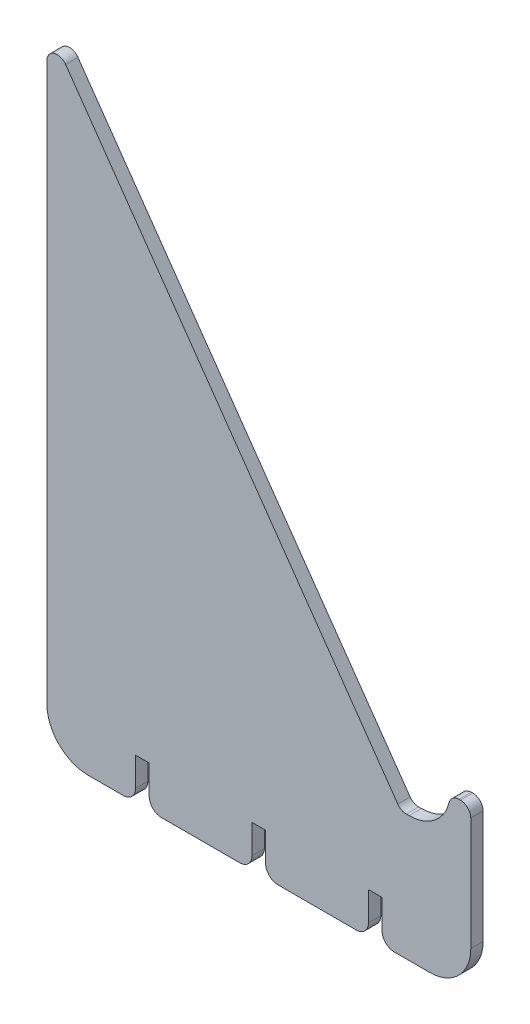
ISO-10303-21;
HEADER;
FILE_DESCRIPTION(('STEP AP214'),'2;1');
FILE_NAME('part.step','',(''),(''),'','','');
FILE_SCHEMA(('AUTOMOTIVE_DESIGN { 1 0 10303 214 1 1 1 1 }'));
ENDSEC;
DATA;
#1=APPLICATION_CONTEXT('core data for automotive mechanical design processes');
#2=APPLICATION_PROTOCOL_DEFINITION('international standard','automotive_design',2000,#1);
#3=PRODUCT_CONTEXT('',#1,'mechanical');
#4=PRODUCT('Part','Part','',(#3));
#5=PRODUCT_RELATED_PRODUCT_CATEGORY('part','',(#4));
#6=PRODUCT_DEFINITION_FORMATION('','',#4);
#7=PRODUCT_DEFINITION_CONTEXT('part definition',#1,'design');
#8=PRODUCT_DEFINITION('design','',#6,#7);
#9=PRODUCT_DEFINITION_SHAPE('','',#8);
#10=(LENGTH_UNIT() NAMED_UNIT(*) SI_UNIT(.MILLI.,.METRE.));
#11=(NAMED_UNIT(*) PLANE_ANGLE_UNIT() SI_UNIT($,.RADIAN.));
#12=(NAMED_UNIT(*) SI_UNIT($,.STERADIAN.) SOLID_ANGLE_UNIT());
#13=UNCERTAINTY_MEASURE_WITH_UNIT(LENGTH_MEASURE(1.E-05),#10,'distance_accuracy_value','');
#14=(GEOMETRIC_REPRESENTATION_CONTEXT(3) GLOBAL_UNCERTAINTY_ASSIGNED_CONTEXT((#13)) GLOBAL_UNIT_ASSIGNED_CONTEXT((#10,
#11,#12)) REPRESENTATION_CONTEXT('',''));
#15=CARTESIAN_POINT('',(0.,0.,0.));
#16=DIRECTION('',(0.,0.,1.));
#17=DIRECTION('',(1.,0.,0.));
#18=AXIS2_PLACEMENT_3D('',#15,#16,#17);
#19=CARTESIAN_POINT('',(91.4835431369997,-161.684305638533,3.));
#20=DIRECTION('',(0.,1.,0.));
#21=DIRECTION('',(0.,0.,1.));
#22=AXIS2_PLACEMENT_3D('',#19,#20,#21);
#23=PLANE('',#22);
#24=DIRECTION('',(1.,0.,0.));
#25=VECTOR('',#24,1.);
#26=CARTESIAN_POINT('',(91.4835431369997,-161.684305638533,3.));
#27=LINE('',#26,#25);
#28=CARTESIAN_POINT('',(26.3216892535985,-161.684305638533,3.));
#29=VERTEX_POINT('',#28);
#30=CARTESIAN_POINT('',(45.3216892535985,-161.684305638533,3.));
#31=VERTEX_POINT('',#30);
#32=EDGE_CURVE('E365',#29,#31,#27,.T.);
#33=ORIENTED_EDGE('',*,*,#32,.F.);
#34=DIRECTION('',(0.,0.,-1.));
#35=VECTOR('',#34,1.);
#36=CARTESIAN_POINT('',(26.3216892535985,-161.684305638533,3.));
#37=LINE('',#36,#35);
#38=CARTESIAN_POINT('',(26.3216892535985,-161.684305638533,0.));
#39=VERTEX_POINT('',#38);
#40=EDGE_CURVE('E523',#29,#39,#37,.T.);
#41=ORIENTED_EDGE('',*,*,#40,.T.);
#42=DIRECTION('',(1.,0.,0.));
#43=VECTOR('',#42,1.);
#44=CARTESIAN_POINT('',(91.4835431369997,-161.684305638533,0.));
#45=LINE('',#44,#43);
#46=CARTESIAN_POINT('',(45.3216892535985,-161.684305638533,0.));
#47=VERTEX_POINT('',#46);
#48=EDGE_CURVE('E408',#39,#47,#45,.T.);
#49=ORIENTED_EDGE('',*,*,#48,.T.);
#50=DIRECTION('',(0.,0.,-1.));
#51=VECTOR('',#50,1.);
#52=CARTESIAN_POINT('',(45.3216892535985,-161.684305638533,3.));
#53=LINE('',#52,#51);
#54=EDGE_CURVE('E520',#47,#31,#53,.F.);
#55=ORIENTED_EDGE('',*,*,#54,.T.);
#56=EDGE_LOOP('',(#33,#41,#49,#55));
#57=FACE_BOUND('',#56,.T.);
#58=ADVANCED_FACE('F39',(#57),#23,.F.);
#59=CARTESIAN_POINT('',(82.9216892535985,-161.684305638533,3.));
#60=VERTEX_POINT('',#59);
#61=CARTESIAN_POINT('',(91.4835431369997,-161.684305638533,3.));
#62=VERTEX_POINT('',#61);
#63=EDGE_CURVE('E360',#60,#62,#27,.T.);
#64=ORIENTED_EDGE('',*,*,#63,.F.);
#65=DIRECTION('',(0.,0.,-1.));
#66=VECTOR('',#65,1.);
#67=CARTESIAN_POINT('',(82.9216892535985,-161.684305638533,3.));
#68=LINE('',#67,#66);
#69=CARTESIAN_POINT('',(82.9216892535985,-161.684305638533,0.));
#70=VERTEX_POINT('',#69);
#71=EDGE_CURVE('E48',#60,#70,#68,.T.);
#72=ORIENTED_EDGE('',*,*,#71,.T.);
#73=CARTESIAN_POINT('',(91.4835431369997,-161.684305638533,0.));
#74=VERTEX_POINT('',#73);
#75=EDGE_CURVE('E402',#70,#74,#45,.T.);
#76=ORIENTED_EDGE('',*,*,#75,.T.);
#77=DIRECTION('',(0.,0.,-1.));
#78=VECTOR('',#77,1.);
#79=CARTESIAN_POINT('',(91.4835431369997,-161.684305638533,3.));
#80=LINE('',#79,#78);
#81=EDGE_CURVE('E455',#62,#74,#80,.T.);
#82=ORIENTED_EDGE('',*,*,#81,.F.);
#83=EDGE_LOOP('',(#64,#72,#76,#82));
#84=FACE_BOUND('',#83,.T.);
#85=ADVANCED_FACE('F551',(#84),#23,.F.);
#86=CARTESIAN_POINT('',(54.6216892535985,-161.684305638533,3.));
#87=VERTEX_POINT('',#86);
#88=CARTESIAN_POINT('',(73.6216892535985,-161.684305638533,3.));
#89=VERTEX_POINT('',#88);
#90=EDGE_CURVE('E597',#87,#89,#27,.T.);
#91=ORIENTED_EDGE('',*,*,#90,.F.);
#92=DIRECTION('',(0.,0.,-1.));
#93=VECTOR('',#92,1.);
#94=CARTESIAN_POINT('',(54.6216892535985,-161.684305638533,3.));
#95=LINE('',#94,#93);
#96=CARTESIAN_POINT('',(54.6216892535985,-161.684305638533,0.));
#97=VERTEX_POINT('',#96);
#98=EDGE_CURVE('E537',#87,#97,#95,.T.);
#99=ORIENTED_EDGE('',*,*,#98,.T.);
#100=CARTESIAN_POINT('',(73.6216892535985,-161.684305638533,0.));
#101=VERTEX_POINT('',#100);
#102=EDGE_CURVE('E561',#97,#101,#45,.T.);
#103=ORIENTED_EDGE('',*,*,#102,.T.);
#104=DIRECTION('',(0.,0.,-1.));
#105=VECTOR('',#104,1.);
#106=CARTESIAN_POINT('',(73.6216892535985,-161.684305638533,3.));
#107=LINE('',#106,#105);
#108=EDGE_CURVE('E534',#101,#89,#107,.F.);
#109=ORIENTED_EDGE('',*,*,#108,.T.);
#110=EDGE_LOOP('',(#91,#99,#103,#109));
#111=FACE_BOUND('',#110,.T.);
#112=ADVANCED_FACE('F596',(#111),#23,.F.);
#113=CARTESIAN_POINT('',(85.797718449232,-128.679339344105,3.));
#114=DIRECTION('',(0.,0.,-1.));
#115=DIRECTION('',(-1.,0.,0.));
#116=AXIS2_PLACEMENT_3D('',#113,#114,#115);
#117=CYLINDRICAL_SURFACE('',#116,2.50000000000001);
#118=CARTESIAN_POINT('',(85.797718449232,-128.679339344105,0.));
#119=DIRECTION('',(0.,0.,-1.));
#120=DIRECTION('',(-1.,0.,0.));
#121=AXIS2_PLACEMENT_3D('',#118,#119,#120);
#122=CIRCLE('',#121,2.50000000000001);
#123=CARTESIAN_POINT('',(85.797718449232,-131.179339344105,0.));
#124=VERTEX_POINT('',#123);
#125=CARTESIAN_POINT('',(83.7498383385094,-130.113280434983,0.));
#126=VERTEX_POINT('',#125);
#127=EDGE_CURVE('E339',#124,#126,#122,.T.);
#128=ORIENTED_EDGE('',*,*,#127,.T.);
#129=DIRECTION('',(0.,0.,-1.));
#130=VECTOR('',#129,1.);
#131=CARTESIAN_POINT('',(83.7498383385094,-130.113280434983,3.));
#132=LINE('',#131,#130);
#133=CARTESIAN_POINT('',(83.7498383385094,-130.113280434983,3.));
#134=VERTEX_POINT('',#133);
#135=EDGE_CURVE('E475',#134,#126,#132,.T.);
#136=ORIENTED_EDGE('',*,*,#135,.F.);
#137=CARTESIAN_POINT('',(85.797718449232,-128.679339344105,3.));
#138=DIRECTION('',(0.,0.,-1.));
#139=DIRECTION('',(-1.,0.,0.));
#140=AXIS2_PLACEMENT_3D('',#137,#138,#139);
#141=CIRCLE('',#140,2.50000000000001);
#142=CARTESIAN_POINT('',(85.797718449232,-131.179339344105,3.));
#143=VERTEX_POINT('',#142);
#144=EDGE_CURVE('E343',#143,#134,#141,.T.);
#145=ORIENTED_EDGE('',*,*,#144,.F.);
#146=DIRECTION('',(0.,0.,-1.));
#147=VECTOR('',#146,1.);
#148=CARTESIAN_POINT('',(85.797718449232,-131.179339344105,3.));
#149=LINE('',#148,#147);
#150=EDGE_CURVE('E386',#143,#124,#149,.T.);
#151=ORIENTED_EDGE('',*,*,#150,.T.);
#152=EDGE_LOOP('',(#128,#136,#145,#151));
#153=FACE_BOUND('',#152,.T.);
#154=ADVANCED_FACE('F641',(#153),#117,.F.);
#155=CARTESIAN_POINT('',(83.7498383385094,-130.113280434983,3.));
#156=DIRECTION('',(-0.819152044288999,-0.573576436351036,0.));
#157=DIRECTION('',(0.573576436351036,-0.819152044288999,0.));
#158=AXIS2_PLACEMENT_3D('',#155,#156,#157);
#159=PLANE('',#158);
#160=DIRECTION('',(-0.573576436351036,0.819152044288999,0.));
#161=VECTOR('',#160,1.);
#162=CARTESIAN_POINT('',(83.7498383385094,-130.113280434983,0.));
#163=LINE('',#162,#161);
#164=CARTESIAN_POINT('',(3.00771548091981,-14.801578615786,0.));
#165=VERTEX_POINT('',#164);
#166=EDGE_CURVE('E390',#126,#165,#163,.T.);
#167=ORIENTED_EDGE('',*,*,#166,.T.);
#168=DIRECTION('',(0.,0.,-1.));
#169=VECTOR('',#168,1.);
#170=CARTESIAN_POINT('',(3.00771548091981,-14.801578615786,3.));
#171=LINE('',#170,#169);
#172=CARTESIAN_POINT('',(3.00771548091981,-14.801578615786,3.));
#173=VERTEX_POINT('',#172);
#174=EDGE_CURVE('E471',#173,#165,#171,.T.);
#175=ORIENTED_EDGE('',*,*,#174,.F.);
#176=DIRECTION('',(-0.573576436351036,0.819152044288999,0.));
#177=VECTOR('',#176,1.);
#178=CARTESIAN_POINT('',(83.7498383385094,-130.113280434983,3.));
#179=LINE('',#178,#177);
#180=EDGE_CURVE('E347',#134,#173,#179,.T.);
#181=ORIENTED_EDGE('',*,*,#180,.F.);
#182=ORIENTED_EDGE('',*,*,#135,.T.);
#183=EDGE_LOOP('',(#167,#175,#181,#182));
#184=FACE_BOUND('',#183,.T.);
#185=ADVANCED_FACE('F646',(#184),#159,.F.);
#186=CARTESIAN_POINT('',(0.959835370197252,-16.2355197066635,3.));
#187=DIRECTION('',(0.,0.,-1.));
#188=DIRECTION('',(-1.,0.,0.));
#189=AXIS2_PLACEMENT_3D('',#186,#187,#188);
#190=CYLINDRICAL_SURFACE('',#189,2.5);
#191=CARTESIAN_POINT('',(0.959835370197252,-16.2355197066635,0.));
#192=DIRECTION('',(0.,0.,1.));
#193=DIRECTION('',(1.,0.,0.));
#194=AXIS2_PLACEMENT_3D('',#191,#192,#193);
#195=CIRCLE('',#194,2.5);
#196=CARTESIAN_POINT('',(-1.54016462980275,-16.2355197066636,0.));
#197=VERTEX_POINT('',#196);
#198=EDGE_CURVE('E393',#165,#197,#195,.T.);
#199=ORIENTED_EDGE('',*,*,#198,.T.);
#200=DIRECTION('',(0.,0.,-1.));
#201=VECTOR('',#200,1.);
#202=CARTESIAN_POINT('',(-1.54016462980275,-16.2355197066636,3.));
#203=LINE('',#202,#201);
#204=CARTESIAN_POINT('',(-1.54016462980275,-16.2355197066636,3.));
#205=VERTEX_POINT('',#204);
#206=EDGE_CURVE('E467',#205,#197,#203,.T.);
#207=ORIENTED_EDGE('',*,*,#206,.F.);
#208=CARTESIAN_POINT('',(0.959835370197252,-16.2355197066635,3.));
#209=DIRECTION('',(0.,0.,1.));
#210=DIRECTION('',(1.,0.,0.));
#211=AXIS2_PLACEMENT_3D('',#208,#209,#210);
#212=CIRCLE('',#211,2.5);
#213=EDGE_CURVE('E351',#173,#205,#212,.T.);
#214=ORIENTED_EDGE('',*,*,#213,.F.);
#215=ORIENTED_EDGE('',*,*,#174,.T.);
#216=EDGE_LOOP('',(#199,#207,#214,#215));
#217=FACE_BOUND('',#216,.T.);
#218=ADVANCED_FACE('F649',(#217),#190,.T.);
#219=CARTESIAN_POINT('',(-1.54016462980274,-151.684305638533,3.));
#220=DIRECTION('',(1.,0.,0.));
#221=DIRECTION('',(0.,1.,0.));
#222=AXIS2_PLACEMENT_3D('',#219,#220,#221);
#223=PLANE('',#222);
#224=DIRECTION('',(0.,-1.,0.));
#225=VECTOR('',#224,1.);
#226=CARTESIAN_POINT('',(-1.54016462980274,-151.684305638533,0.));
#227=LINE('',#226,#225);
#228=CARTESIAN_POINT('',(-1.54016462980274,-151.684305638533,0.));
#229=VERTEX_POINT('',#228);
#230=EDGE_CURVE('E396',#197,#229,#227,.T.);
#231=ORIENTED_EDGE('',*,*,#230,.T.);
#232=DIRECTION('',(0.,0.,-1.));
#233=VECTOR('',#232,1.);
#234=CARTESIAN_POINT('',(-1.54016462980274,-151.684305638533,3.));
#235=LINE('',#234,#233);
#236=CARTESIAN_POINT('',(-1.54016462980274,-151.684305638533,3.));
#237=VERTEX_POINT('',#236);
#238=EDGE_CURVE('E463',#237,#229,#235,.T.);
#239=ORIENTED_EDGE('',*,*,#238,.F.);
#240=DIRECTION('',(0.,-1.,0.));
#241=VECTOR('',#240,1.);
#242=CARTESIAN_POINT('',(-1.54016462980274,-151.684305638533,3.));
#243=LINE('',#242,#241);
#244=EDGE_CURVE('E354',#205,#237,#243,.T.);
#245=ORIENTED_EDGE('',*,*,#244,.F.);
#246=ORIENTED_EDGE('',*,*,#206,.T.);
#247=EDGE_LOOP('',(#231,#239,#245,#246));
#248=FACE_BOUND('',#247,.T.);
#249=ADVANCED_FACE('F654',(#248),#223,.F.);
#250=CARTESIAN_POINT('',(8.45983537019726,-151.684305638533,3.));
#251=DIRECTION('',(0.,0.,-1.));
#252=DIRECTION('',(-1.,0.,0.));
#253=AXIS2_PLACEMENT_3D('',#250,#251,#252);
#254=CYLINDRICAL_SURFACE('',#253,10.);
#255=CARTESIAN_POINT('',(8.45983537019726,-151.684305638533,0.));
#256=DIRECTION('',(0.,0.,1.));
#257=DIRECTION('',(-1.,0.,0.));
#258=AXIS2_PLACEMENT_3D('',#255,#256,#257);
#259=CIRCLE('',#258,10.);
#260=CARTESIAN_POINT('',(8.45983537019726,-161.684305638533,0.));
#261=VERTEX_POINT('',#260);
#262=EDGE_CURVE('E399',#229,#261,#259,.T.);
#263=ORIENTED_EDGE('',*,*,#262,.T.);
#264=DIRECTION('',(0.,0.,-1.));
#265=VECTOR('',#264,1.);
#266=CARTESIAN_POINT('',(8.45983537019726,-161.684305638533,3.));
#267=LINE('',#266,#265);
#268=CARTESIAN_POINT('',(8.45983537019726,-161.684305638533,3.));
#269=VERTEX_POINT('',#268);
#270=EDGE_CURVE('E459',#269,#261,#267,.T.);
#271=ORIENTED_EDGE('',*,*,#270,.F.);
#272=CARTESIAN_POINT('',(8.45983537019726,-151.684305638533,3.));
#273=DIRECTION('',(0.,0.,1.));
#274=DIRECTION('',(-1.,0.,0.));
#275=AXIS2_PLACEMENT_3D('',#272,#273,#274);
#276=CIRCLE('',#275,10.);
#277=EDGE_CURVE('E357',#237,#269,#276,.T.);
#278=ORIENTED_EDGE('',*,*,#277,.F.);
#279=ORIENTED_EDGE('',*,*,#238,.T.);
#280=EDGE_LOOP('',(#263,#271,#278,#279));
#281=FACE_BOUND('',#280,.T.);
#282=ADVANCED_FACE('F660',(#281),#254,.T.);
#283=CARTESIAN_POINT('',(17.0216892535985,-161.684305638533,0.));
#284=VERTEX_POINT('',#283);
#285=EDGE_CURVE('E403',#261,#284,#45,.T.);
#286=ORIENTED_EDGE('',*,*,#285,.T.);
#287=DIRECTION('',(0.,0.,-1.));
#288=VECTOR('',#287,1.);
#289=CARTESIAN_POINT('',(17.0216892535985,-161.684305638533,3.));
#290=LINE('',#289,#288);
#291=CARTESIAN_POINT('',(17.0216892535985,-161.684305638533,3.));
#292=VERTEX_POINT('',#291);
#293=EDGE_CURVE('E501',#284,#292,#290,.F.);
#294=ORIENTED_EDGE('',*,*,#293,.T.);
#295=EDGE_CURVE('E361',#269,#292,#27,.T.);
#296=ORIENTED_EDGE('',*,*,#295,.F.);
#297=ORIENTED_EDGE('',*,*,#270,.T.);
#298=EDGE_LOOP('',(#286,#294,#296,#297));
#299=FACE_BOUND('',#298,.T.);
#300=ADVANCED_FACE('F664',(#299),#23,.F.);
#301=CARTESIAN_POINT('',(91.4835431369997,-151.684305638533,3.));
#302=DIRECTION('',(0.,0.,-1.));
#303=DIRECTION('',(-1.,0.,0.));
#304=AXIS2_PLACEMENT_3D('',#301,#302,#303);
#305=CYLINDRICAL_SURFACE('',#304,10.);
#306=CARTESIAN_POINT('',(91.4835431369997,-151.684305638533,0.));
#307=DIRECTION('',(0.,0.,1.));
#308=DIRECTION('',(-1.,0.,0.));
#309=AXIS2_PLACEMENT_3D('',#306,#307,#308);
#310=CIRCLE('',#309,10.);
#311=CARTESIAN_POINT('',(101.483543137,-151.684305638533,0.));
#312=VERTEX_POINT('',#311);
#313=EDGE_CURVE('E407',#74,#312,#310,.T.);
#314=ORIENTED_EDGE('',*,*,#313,.T.);
#315=DIRECTION('',(0.,0.,-1.));
#316=VECTOR('',#315,1.);
#317=CARTESIAN_POINT('',(101.483543137,-151.684305638533,3.));
#318=LINE('',#317,#316);
#319=CARTESIAN_POINT('',(101.483543137,-151.684305638533,3.));
#320=VERTEX_POINT('',#319);
#321=EDGE_CURVE('E451',#320,#312,#318,.T.);
#322=ORIENTED_EDGE('',*,*,#321,.F.);
#323=CARTESIAN_POINT('',(91.4835431369997,-151.684305638533,3.));
#324=DIRECTION('',(0.,0.,1.));
#325=DIRECTION('',(-1.,0.,0.));
#326=AXIS2_PLACEMENT_3D('',#323,#324,#325);
#327=CIRCLE('',#326,10.);
#328=EDGE_CURVE('E364',#62,#320,#327,.T.);
#329=ORIENTED_EDGE('',*,*,#328,.F.);
#330=ORIENTED_EDGE('',*,*,#81,.T.);
#331=EDGE_LOOP('',(#314,#322,#329,#330));
#332=FACE_BOUND('',#331,.T.);
#333=ADVANCED_FACE('F607',(#332),#305,.T.);
#334=CARTESIAN_POINT('',(101.483543137,-124.184305638533,3.));
#335=DIRECTION('',(-1.,0.,0.));
#336=DIRECTION('',(0.,0.,1.));
#337=AXIS2_PLACEMENT_3D('',#334,#335,#336);
#338=PLANE('',#337);
#339=DIRECTION('',(0.,1.,0.));
#340=VECTOR('',#339,1.);
#341=CARTESIAN_POINT('',(101.483543137,-124.184305638533,0.));
#342=LINE('',#341,#340);
#343=CARTESIAN_POINT('',(101.483543137,-124.184305638533,0.));
#344=VERTEX_POINT('',#343);
#345=EDGE_CURVE('E411',#312,#344,#342,.T.);
#346=ORIENTED_EDGE('',*,*,#345,.T.);
#347=DIRECTION('',(0.,0.,-1.));
#348=VECTOR('',#347,1.);
#349=CARTESIAN_POINT('',(101.483543137,-124.184305638533,3.));
#350=LINE('',#349,#348);
#351=CARTESIAN_POINT('',(101.483543137,-124.184305638533,3.));
#352=VERTEX_POINT('',#351);
#353=EDGE_CURVE('E447',#352,#344,#350,.T.);
#354=ORIENTED_EDGE('',*,*,#353,.F.);
#355=DIRECTION('',(0.,1.,0.));
#356=VECTOR('',#355,1.);
#357=CARTESIAN_POINT('',(101.483543137,-124.184305638533,3.));
#358=LINE('',#357,#356);
#359=EDGE_CURVE('E368',#320,#352,#358,.T.);
#360=ORIENTED_EDGE('',*,*,#359,.F.);
#361=ORIENTED_EDGE('',*,*,#321,.T.);
#362=EDGE_LOOP('',(#346,#354,#360,#361));
#363=FACE_BOUND('',#362,.T.);
#364=ADVANCED_FACE('F611',(#363),#338,.F.);
#365=CARTESIAN_POINT('',(98.9835431369997,-124.184305638533,3.));
#366=DIRECTION('',(0.,0.,-1.));
#367=DIRECTION('',(-1.,0.,0.));
#368=AXIS2_PLACEMENT_3D('',#365,#366,#367);
#369=CYLINDRICAL_SURFACE('',#368,2.5);
#370=CARTESIAN_POINT('',(98.9835431369997,-124.184305638533,0.));
#371=DIRECTION('',(0.,0.,1.));
#372=DIRECTION('',(-1.,0.,0.));
#373=AXIS2_PLACEMENT_3D('',#370,#371,#372);
#374=CIRCLE('',#373,2.5);
#375=CARTESIAN_POINT('',(98.9835431369997,-121.684305638533,0.));
#376=VERTEX_POINT('',#375);
#377=EDGE_CURVE('E414',#344,#376,#374,.T.);
#378=ORIENTED_EDGE('',*,*,#377,.T.);
#379=DIRECTION('',(0.,0.,-1.));
#380=VECTOR('',#379,1.);
#381=CARTESIAN_POINT('',(98.9835431369997,-121.684305638533,3.));
#382=LINE('',#381,#380);
#383=CARTESIAN_POINT('',(98.9835431369997,-121.684305638533,3.));
#384=VERTEX_POINT('',#383);
#385=EDGE_CURVE('E443',#384,#376,#382,.T.);
#386=ORIENTED_EDGE('',*,*,#385,.F.);
#387=CARTESIAN_POINT('',(98.9835431369997,-124.184305638533,3.));
#388=DIRECTION('',(0.,0.,1.));
#389=DIRECTION('',(-1.,0.,0.));
#390=AXIS2_PLACEMENT_3D('',#387,#388,#389);
#391=CIRCLE('',#390,2.5);
#392=EDGE_CURVE('E371',#352,#384,#391,.T.);
#393=ORIENTED_EDGE('',*,*,#392,.F.);
#394=ORIENTED_EDGE('',*,*,#353,.T.);
#395=EDGE_LOOP('',(#378,#386,#393,#394));
#396=FACE_BOUND('',#395,.T.);
#397=ADVANCED_FACE('F617',(#396),#369,.T.);
#398=CARTESIAN_POINT('',(98.6297330482927,-121.684305638533,3.));
#399=DIRECTION('',(0.,-1.,0.));
#400=DIRECTION('',(0.,0.,-1.));
#401=AXIS2_PLACEMENT_3D('',#398,#399,#400);
#402=PLANE('',#401);
#403=DIRECTION('',(-1.,0.,0.));
#404=VECTOR('',#403,1.);
#405=CARTESIAN_POINT('',(98.6297330482927,-121.684305638533,0.));
#406=LINE('',#405,#404);
#407=CARTESIAN_POINT('',(98.6297330482927,-121.684305638533,0.));
#408=VERTEX_POINT('',#407);
#409=EDGE_CURVE('E417',#376,#408,#406,.T.);
#410=ORIENTED_EDGE('',*,*,#409,.T.);
#411=DIRECTION('',(0.,0.,-1.));
#412=VECTOR('',#411,1.);
#413=CARTESIAN_POINT('',(98.6297330482927,-121.684305638533,3.));
#414=LINE('',#413,#412);
#415=CARTESIAN_POINT('',(98.6297330482927,-121.684305638533,3.));
#416=VERTEX_POINT('',#415);
#417=EDGE_CURVE('E439',#416,#408,#414,.T.);
#418=ORIENTED_EDGE('',*,*,#417,.F.);
#419=DIRECTION('',(-1.,0.,0.));
#420=VECTOR('',#419,1.);
#421=CARTESIAN_POINT('',(98.6297330482927,-121.684305638533,3.));
#422=LINE('',#421,#420);
#423=EDGE_CURVE('E374',#384,#416,#422,.T.);
#424=ORIENTED_EDGE('',*,*,#423,.F.);
#425=ORIENTED_EDGE('',*,*,#385,.T.);
#426=EDGE_LOOP('',(#410,#418,#424,#425));
#427=FACE_BOUND('',#426,.T.);
#428=ADVANCED_FACE('F621',(#427),#402,.F.);
#429=CARTESIAN_POINT('',(98.6297330482927,-124.184305638533,3.));
#430=DIRECTION('',(0.,0.,-1.));
#431=DIRECTION('',(-1.,0.,0.));
#432=AXIS2_PLACEMENT_3D('',#429,#430,#431);
#433=CYLINDRICAL_SURFACE('',#432,2.5);
#434=CARTESIAN_POINT('',(98.6297330482927,-124.184305638533,0.));
#435=DIRECTION('',(0.,0.,1.));
#436=DIRECTION('',(-1.,0.,0.));
#437=AXIS2_PLACEMENT_3D('',#434,#435,#436);
#438=CIRCLE('',#437,2.5);
#439=CARTESIAN_POINT('',(96.2030466032047,-123.583312379648,0.));
#440=VERTEX_POINT('',#439);
#441=EDGE_CURVE('E420',#408,#440,#438,.T.);
#442=ORIENTED_EDGE('',*,*,#441,.T.);
#443=DIRECTION('',(0.,0.,-1.));
#444=VECTOR('',#443,1.);
#445=CARTESIAN_POINT('',(96.2030466032047,-123.583312379648,3.));
#446=LINE('',#445,#444);
#447=CARTESIAN_POINT('',(96.2030466032047,-123.583312379648,3.));
#448=VERTEX_POINT('',#447);
#449=EDGE_CURVE('E435',#448,#440,#446,.T.);
#450=ORIENTED_EDGE('',*,*,#449,.F.);
#451=CARTESIAN_POINT('',(98.6297330482927,-124.184305638533,3.));
#452=DIRECTION('',(0.,0.,1.));
#453=DIRECTION('',(-1.,0.,0.));
#454=AXIS2_PLACEMENT_3D('',#451,#452,#453);
#455=CIRCLE('',#454,2.5);
#456=EDGE_CURVE('E377',#416,#448,#455,.T.);
#457=ORIENTED_EDGE('',*,*,#456,.F.);
#458=ORIENTED_EDGE('',*,*,#417,.T.);
#459=EDGE_LOOP('',(#442,#450,#457,#458));
#460=FACE_BOUND('',#459,.T.);
#461=ADVANCED_FACE('F626',(#460),#433,.T.);
#462=CARTESIAN_POINT('',(86.4963008228525,-121.179339344105,3.));
#463=DIRECTION('',(0.,0.,-1.));
#464=DIRECTION('',(-1.,0.,0.));
#465=AXIS2_PLACEMENT_3D('',#462,#463,#464);
#466=CYLINDRICAL_SURFACE('',#465,10.);
#467=CARTESIAN_POINT('',(86.4963008228525,-121.179339344105,0.));
#468=DIRECTION('',(0.,0.,-1.));
#469=DIRECTION('',(-1.,0.,0.));
#470=AXIS2_PLACEMENT_3D('',#467,#468,#469);
#471=CIRCLE('',#470,10.);
#472=CARTESIAN_POINT('',(86.4963008228525,-131.179339344105,0.));
#473=VERTEX_POINT('',#472);
#474=EDGE_CURVE('E423',#440,#473,#471,.T.);
#475=ORIENTED_EDGE('',*,*,#474,.T.);
#476=DIRECTION('',(0.,0.,-1.));
#477=VECTOR('',#476,1.);
#478=CARTESIAN_POINT('',(86.4963008228525,-131.179339344105,3.));
#479=LINE('',#478,#477);
#480=CARTESIAN_POINT('',(86.4963008228525,-131.179339344105,3.));
#481=VERTEX_POINT('',#480);
#482=EDGE_CURVE('E431',#481,#473,#479,.T.);
#483=ORIENTED_EDGE('',*,*,#482,.F.);
#484=CARTESIAN_POINT('',(86.4963008228525,-121.179339344105,3.));
#485=DIRECTION('',(0.,0.,-1.));
#486=DIRECTION('',(-1.,0.,0.));
#487=AXIS2_PLACEMENT_3D('',#484,#485,#486);
#488=CIRCLE('',#487,10.);
#489=EDGE_CURVE('E380',#448,#481,#488,.T.);
#490=ORIENTED_EDGE('',*,*,#489,.F.);
#491=ORIENTED_EDGE('',*,*,#449,.T.);
#492=EDGE_LOOP('',(#475,#483,#490,#491));
#493=FACE_BOUND('',#492,.T.);
#494=ADVANCED_FACE('F632',(#493),#466,.F.);
#495=CARTESIAN_POINT('',(86.4963008228525,-131.179339344105,3.));
#496=DIRECTION('',(0.,-1.,0.));
#497=DIRECTION('',(0.,0.,-1.));
#498=AXIS2_PLACEMENT_3D('',#495,#496,#497);
#499=PLANE('',#498);
#500=DIRECTION('',(-1.,0.,0.));
#501=VECTOR('',#500,1.);
#502=CARTESIAN_POINT('',(86.4963008228525,-131.179339344105,0.));
#503=LINE('',#502,#501);
#504=EDGE_CURVE('E348',#473,#124,#503,.T.);
#505=ORIENTED_EDGE('',*,*,#504,.T.);
#506=ORIENTED_EDGE('',*,*,#150,.F.);
#507=DIRECTION('',(-1.,0.,0.));
#508=VECTOR('',#507,1.);
#509=CARTESIAN_POINT('',(86.4963008228525,-131.179339344105,3.));
#510=LINE('',#509,#508);
#511=EDGE_CURVE('E383',#481,#143,#510,.T.);
#512=ORIENTED_EDGE('',*,*,#511,.F.);
#513=ORIENTED_EDGE('',*,*,#482,.T.);
#514=EDGE_LOOP('',(#505,#506,#512,#513));
#515=FACE_BOUND('',#514,.T.);
#516=ADVANCED_FACE('F636',(#515),#499,.F.);
#517=CARTESIAN_POINT('',(85.797718449232,-128.679339344105,3.));
#518=DIRECTION('',(0.,0.,-1.));
#519=DIRECTION('',(-1.,0.,0.));
#520=AXIS2_PLACEMENT_3D('',#517,#518,#519);
#521=PLANE('',#520);
#522=ORIENTED_EDGE('',*,*,#295,.T.);
#523=CARTESIAN_POINT('',(17.0216892535985,-158.684305638533,3.));
#524=DIRECTION('',(0.,0.,-1.));
#525=DIRECTION('',(-1.,0.,0.));
#526=AXIS2_PLACEMENT_3D('',#523,#524,#525);
#527=CIRCLE('',#526,3.);
#528=CARTESIAN_POINT('',(20.0216892535985,-158.684305638533,3.));
#529=VERTEX_POINT('',#528);
#530=EDGE_CURVE('E517',#292,#529,#527,.F.);
#531=ORIENTED_EDGE('',*,*,#530,.T.);
#532=DIRECTION('',(0.,1.,0.));
#533=VECTOR('',#532,1.);
#534=CARTESIAN_POINT('',(20.0216892535985,-161.684305638533,3.));
#535=LINE('',#534,#533);
#536=CARTESIAN_POINT('',(20.0216892535985,-151.684305638533,3.));
#537=VERTEX_POINT('',#536);
#538=EDGE_CURVE('E290',#529,#537,#535,.T.);
#539=ORIENTED_EDGE('',*,*,#538,.T.);
#540=DIRECTION('',(1.,0.,0.));
#541=VECTOR('',#540,1.);
#542=CARTESIAN_POINT('',(23.3216892535985,-151.684305638533,3.));
#543=LINE('',#542,#541);
#544=CARTESIAN_POINT('',(23.3216892535985,-151.684305638533,3.));
#545=VERTEX_POINT('',#544);
#546=EDGE_CURVE('E294',#537,#545,#543,.T.);
#547=ORIENTED_EDGE('',*,*,#546,.T.);
#548=DIRECTION('',(0.,-1.,0.));
#549=VECTOR('',#548,1.);
#550=CARTESIAN_POINT('',(23.3216892535985,-161.684305638533,3.));
#551=LINE('',#550,#549);
#552=CARTESIAN_POINT('',(23.3216892535985,-158.684305638533,3.));
#553=VERTEX_POINT('',#552);
#554=EDGE_CURVE('E286',#545,#553,#551,.T.);
#555=ORIENTED_EDGE('',*,*,#554,.T.);
#556=CARTESIAN_POINT('',(26.3216892535985,-158.684305638533,3.));
#557=DIRECTION('',(0.,0.,-1.));
#558=DIRECTION('',(-1.,0.,0.));
#559=AXIS2_PLACEMENT_3D('',#556,#557,#558);
#560=CIRCLE('',#559,3.);
#561=EDGE_CURVE('E514',#553,#29,#560,.F.);
#562=ORIENTED_EDGE('',*,*,#561,.T.);
#563=ORIENTED_EDGE('',*,*,#32,.T.);
#564=CARTESIAN_POINT('',(45.3216892535985,-158.684305638533,3.));
#565=DIRECTION('',(0.,0.,-1.));
#566=DIRECTION('',(-1.,0.,0.));
#567=AXIS2_PLACEMENT_3D('',#564,#565,#566);
#568=CIRCLE('',#567,3.);
#569=CARTESIAN_POINT('',(48.3216892535985,-158.684305638533,3.));
#570=VERTEX_POINT('',#569);
#571=EDGE_CURVE('E511',#31,#570,#568,.F.);
#572=ORIENTED_EDGE('',*,*,#571,.T.);
#573=DIRECTION('',(0.,1.,0.));
#574=VECTOR('',#573,1.);
#575=CARTESIAN_POINT('',(48.3216892535985,-161.684305638533,3.));
#576=LINE('',#575,#574);
#577=CARTESIAN_POINT('',(48.3216892535985,-151.684305638533,3.));
#578=VERTEX_POINT('',#577);
#579=EDGE_CURVE('E314',#570,#578,#576,.T.);
#580=ORIENTED_EDGE('',*,*,#579,.T.);
#581=DIRECTION('',(1.,0.,0.));
#582=VECTOR('',#581,1.);
#583=CARTESIAN_POINT('',(51.6216892535985,-151.684305638533,3.));
#584=LINE('',#583,#582);
#585=CARTESIAN_POINT('',(51.6216892535985,-151.684305638533,3.));
#586=VERTEX_POINT('',#585);
#587=EDGE_CURVE('E317',#578,#586,#584,.T.);
#588=ORIENTED_EDGE('',*,*,#587,.T.);
#589=DIRECTION('',(0.,-1.,0.));
#590=VECTOR('',#589,1.);
#591=CARTESIAN_POINT('',(51.6216892535985,-161.684305638533,3.));
#592=LINE('',#591,#590);
#593=CARTESIAN_POINT('',(51.6216892535985,-158.684305638533,3.));
#594=VERTEX_POINT('',#593);
#595=EDGE_CURVE('E322',#586,#594,#592,.T.);
#596=ORIENTED_EDGE('',*,*,#595,.T.);
#597=CARTESIAN_POINT('',(54.6216892535985,-158.684305638533,3.));
#598=DIRECTION('',(0.,0.,-1.));
#599=DIRECTION('',(-1.,0.,0.));
#600=AXIS2_PLACEMENT_3D('',#597,#598,#599);
#601=CIRCLE('',#600,3.);
#602=EDGE_CURVE('E508',#594,#87,#601,.F.);
#603=ORIENTED_EDGE('',*,*,#602,.T.);
#604=ORIENTED_EDGE('',*,*,#90,.T.);
#605=CARTESIAN_POINT('',(73.6216892535985,-158.684305638533,3.));
#606=DIRECTION('',(0.,0.,-1.));
#607=DIRECTION('',(-1.,0.,0.));
#608=AXIS2_PLACEMENT_3D('',#605,#606,#607);
#609=CIRCLE('',#608,3.);
#610=CARTESIAN_POINT('',(76.6216892535985,-158.684305638533,3.));
#611=VERTEX_POINT('',#610);
#612=EDGE_CURVE('E250',#89,#611,#609,.F.);
#613=ORIENTED_EDGE('',*,*,#612,.T.);
#614=DIRECTION('',(0.,1.,0.));
#615=VECTOR('',#614,1.);
#616=CARTESIAN_POINT('',(76.6216892535985,-161.684305638533,3.));
#617=LINE('',#616,#615);
#618=CARTESIAN_POINT('',(76.6216892535985,-151.684305638533,3.));
#619=VERTEX_POINT('',#618);
#620=EDGE_CURVE('E242',#611,#619,#617,.T.);
#621=ORIENTED_EDGE('',*,*,#620,.T.);
#622=DIRECTION('',(1.,0.,0.));
#623=VECTOR('',#622,1.);
#624=CARTESIAN_POINT('',(79.9216892535985,-151.684305638533,3.));
#625=LINE('',#624,#623);
#626=CARTESIAN_POINT('',(79.9216892535985,-151.684305638533,3.));
#627=VERTEX_POINT('',#626);
#628=EDGE_CURVE('E247',#619,#627,#625,.T.);
#629=ORIENTED_EDGE('',*,*,#628,.T.);
#630=DIRECTION('',(0.,-1.,0.));
#631=VECTOR('',#630,1.);
#632=CARTESIAN_POINT('',(79.9216892535985,-161.684305638533,3.));
#633=LINE('',#632,#631);
#634=CARTESIAN_POINT('',(79.9216892535985,-158.684305638533,3.));
#635=VERTEX_POINT('',#634);
#636=EDGE_CURVE('E267',#627,#635,#633,.T.);
#637=ORIENTED_EDGE('',*,*,#636,.T.);
#638=CARTESIAN_POINT('',(82.9216892535985,-158.684305638533,3.));
#639=DIRECTION('',(0.,0.,-1.));
#640=DIRECTION('',(-1.,0.,0.));
#641=AXIS2_PLACEMENT_3D('',#638,#639,#640);
#642=CIRCLE('',#641,3.);
#643=EDGE_CURVE('E55',#635,#60,#642,.F.);
#644=ORIENTED_EDGE('',*,*,#643,.T.);
#645=ORIENTED_EDGE('',*,*,#63,.T.);
#646=ORIENTED_EDGE('',*,*,#328,.T.);
#647=ORIENTED_EDGE('',*,*,#359,.T.);
#648=ORIENTED_EDGE('',*,*,#392,.T.);
#649=ORIENTED_EDGE('',*,*,#423,.T.);
#650=ORIENTED_EDGE('',*,*,#456,.T.);
#651=ORIENTED_EDGE('',*,*,#489,.T.);
#652=ORIENTED_EDGE('',*,*,#511,.T.);
#653=ORIENTED_EDGE('',*,*,#144,.T.);
#654=ORIENTED_EDGE('',*,*,#180,.T.);
#655=ORIENTED_EDGE('',*,*,#213,.T.);
#656=ORIENTED_EDGE('',*,*,#244,.T.);
#657=ORIENTED_EDGE('',*,*,#277,.T.);
#658=EDGE_LOOP('',(#522,#531,#539,#547,#555,#562,#563,#572,#580,#588,#596,#603,#604,#613,#621,
#629,#637,#644,#645,#646,#647,#648,#649,#650,#651,#652,#653,#654,#655,#656,#657));
#659=FACE_BOUND('',#658,.T.);
#660=ADVANCED_FACE('F245',(#659),#521,.F.);
#661=CARTESIAN_POINT('',(85.797718449232,-128.679339344105,0.));
#662=DIRECTION('',(0.,0.,-1.));
#663=DIRECTION('',(-1.,0.,0.));
#664=AXIS2_PLACEMENT_3D('',#661,#662,#663);
#665=PLANE('',#664);
#666=DIRECTION('',(0.,1.,0.));
#667=VECTOR('',#666,1.);
#668=CARTESIAN_POINT('',(20.0216892535985,-161.684305638533,0.));
#669=LINE('',#668,#667);
#670=CARTESIAN_POINT('',(20.0216892535985,-158.684305638533,0.));
#671=VERTEX_POINT('',#670);
#672=CARTESIAN_POINT('',(20.0216892535985,-151.684305638533,0.));
#673=VERTEX_POINT('',#672);
#674=EDGE_CURVE('E303',#671,#673,#669,.T.);
#675=ORIENTED_EDGE('',*,*,#674,.F.);
#676=CARTESIAN_POINT('',(17.0216892535985,-158.684305638533,0.));
#677=DIRECTION('',(0.,0.,-1.));
#678=DIRECTION('',(-1.,0.,0.));
#679=AXIS2_PLACEMENT_3D('',#676,#677,#678);
#680=CIRCLE('',#679,3.);
#681=EDGE_CURVE('E498',#671,#284,#680,.T.);
#682=ORIENTED_EDGE('',*,*,#681,.T.);
#683=ORIENTED_EDGE('',*,*,#285,.F.);
#684=ORIENTED_EDGE('',*,*,#262,.F.);
#685=ORIENTED_EDGE('',*,*,#230,.F.);
#686=ORIENTED_EDGE('',*,*,#198,.F.);
#687=ORIENTED_EDGE('',*,*,#166,.F.);
#688=ORIENTED_EDGE('',*,*,#127,.F.);
#689=ORIENTED_EDGE('',*,*,#504,.F.);
#690=ORIENTED_EDGE('',*,*,#474,.F.);
#691=ORIENTED_EDGE('',*,*,#441,.F.);
#692=ORIENTED_EDGE('',*,*,#409,.F.);
#693=ORIENTED_EDGE('',*,*,#377,.F.);
#694=ORIENTED_EDGE('',*,*,#345,.F.);
#695=ORIENTED_EDGE('',*,*,#313,.F.);
#696=ORIENTED_EDGE('',*,*,#75,.F.);
#697=CARTESIAN_POINT('',(82.9216892535985,-158.684305638533,0.));
#698=DIRECTION('',(0.,0.,-1.));
#699=DIRECTION('',(-1.,0.,0.));
#700=AXIS2_PLACEMENT_3D('',#697,#698,#699);
#701=CIRCLE('',#700,3.);
#702=CARTESIAN_POINT('',(79.9216892535985,-158.684305638533,0.));
#703=VERTEX_POINT('',#702);
#704=EDGE_CURVE('E483',#70,#703,#701,.T.);
#705=ORIENTED_EDGE('',*,*,#704,.T.);
#706=DIRECTION('',(0.,-1.,0.));
#707=VECTOR('',#706,1.);
#708=CARTESIAN_POINT('',(79.9216892535985,-161.684305638533,0.));
#709=LINE('',#708,#707);
#710=CARTESIAN_POINT('',(79.9216892535985,-151.684305638533,0.));
#711=VERTEX_POINT('',#710);
#712=EDGE_CURVE('E255',#711,#703,#709,.T.);
#713=ORIENTED_EDGE('',*,*,#712,.F.);
#714=DIRECTION('',(1.,0.,0.));
#715=VECTOR('',#714,1.);
#716=CARTESIAN_POINT('',(79.9216892535985,-151.684305638533,0.));
#717=LINE('',#716,#715);
#718=CARTESIAN_POINT('',(76.6216892535985,-151.684305638533,0.));
#719=VERTEX_POINT('',#718);
#720=EDGE_CURVE('E277',#719,#711,#717,.T.);
#721=ORIENTED_EDGE('',*,*,#720,.F.);
#722=DIRECTION('',(0.,1.,0.));
#723=VECTOR('',#722,1.);
#724=CARTESIAN_POINT('',(76.6216892535985,-161.684305638533,0.));
#725=LINE('',#724,#723);
#726=CARTESIAN_POINT('',(76.6216892535985,-158.684305638533,0.));
#727=VERTEX_POINT('',#726);
#728=EDGE_CURVE('E261',#727,#719,#725,.T.);
#729=ORIENTED_EDGE('',*,*,#728,.F.);
#730=CARTESIAN_POINT('',(73.6216892535985,-158.684305638533,0.));
#731=DIRECTION('',(0.,0.,-1.));
#732=DIRECTION('',(-1.,0.,0.));
#733=AXIS2_PLACEMENT_3D('',#730,#731,#732);
#734=CIRCLE('',#733,3.);
#735=EDGE_CURVE('E486',#727,#101,#734,.T.);
#736=ORIENTED_EDGE('',*,*,#735,.T.);
#737=ORIENTED_EDGE('',*,*,#102,.F.);
#738=CARTESIAN_POINT('',(54.6216892535985,-158.684305638533,0.));
#739=DIRECTION('',(0.,0.,-1.));
#740=DIRECTION('',(-1.,0.,0.));
#741=AXIS2_PLACEMENT_3D('',#738,#739,#740);
#742=CIRCLE('',#741,3.);
#743=CARTESIAN_POINT('',(51.6216892535985,-158.684305638533,0.));
#744=VERTEX_POINT('',#743);
#745=EDGE_CURVE('E489',#97,#744,#742,.T.);
#746=ORIENTED_EDGE('',*,*,#745,.T.);
#747=DIRECTION('',(0.,-1.,0.));
#748=VECTOR('',#747,1.);
#749=CARTESIAN_POINT('',(51.6216892535985,-161.684305638533,0.));
#750=LINE('',#749,#748);
#751=CARTESIAN_POINT('',(51.6216892535985,-151.684305638533,0.));
#752=VERTEX_POINT('',#751);
#753=EDGE_CURVE('E318',#752,#744,#750,.T.);
#754=ORIENTED_EDGE('',*,*,#753,.F.);
#755=DIRECTION('',(1.,0.,0.));
#756=VECTOR('',#755,1.);
#757=CARTESIAN_POINT('',(51.6216892535985,-151.684305638533,0.));
#758=LINE('',#757,#756);
#759=CARTESIAN_POINT('',(48.3216892535985,-151.684305638533,0.));
#760=VERTEX_POINT('',#759);
#761=EDGE_CURVE('E329',#760,#752,#758,.T.);
#762=ORIENTED_EDGE('',*,*,#761,.F.);
#763=DIRECTION('',(0.,1.,0.));
#764=VECTOR('',#763,1.);
#765=CARTESIAN_POINT('',(48.3216892535985,-161.684305638533,0.));
#766=LINE('',#765,#764);
#767=CARTESIAN_POINT('',(48.3216892535985,-158.684305638533,0.));
#768=VERTEX_POINT('',#767);
#769=EDGE_CURVE('E284',#768,#760,#766,.T.);
#770=ORIENTED_EDGE('',*,*,#769,.F.);
#771=CARTESIAN_POINT('',(45.3216892535985,-158.684305638533,0.));
#772=DIRECTION('',(0.,0.,-1.));
#773=DIRECTION('',(-1.,0.,0.));
#774=AXIS2_PLACEMENT_3D('',#771,#772,#773);
#775=CIRCLE('',#774,3.);
#776=EDGE_CURVE('E492',#768,#47,#775,.T.);
#777=ORIENTED_EDGE('',*,*,#776,.T.);
#778=ORIENTED_EDGE('',*,*,#48,.F.);
#779=CARTESIAN_POINT('',(26.3216892535985,-158.684305638533,0.));
#780=DIRECTION('',(0.,0.,-1.));
#781=DIRECTION('',(-1.,0.,0.));
#782=AXIS2_PLACEMENT_3D('',#779,#780,#781);
#783=CIRCLE('',#782,3.);
#784=CARTESIAN_POINT('',(23.3216892535985,-158.684305638533,0.));
#785=VERTEX_POINT('',#784);
#786=EDGE_CURVE('E495',#39,#785,#783,.T.);
#787=ORIENTED_EDGE('',*,*,#786,.T.);
#788=DIRECTION('',(0.,-1.,0.));
#789=VECTOR('',#788,1.);
#790=CARTESIAN_POINT('',(23.3216892535985,-161.684305638533,0.));
#791=LINE('',#790,#789);
#792=CARTESIAN_POINT('',(23.3216892535985,-151.684305638533,0.));
#793=VERTEX_POINT('',#792);
#794=EDGE_CURVE('E299',#793,#785,#791,.T.);
#795=ORIENTED_EDGE('',*,*,#794,.F.);
#796=DIRECTION('',(1.,0.,0.));
#797=VECTOR('',#796,1.);
#798=CARTESIAN_POINT('',(23.3216892535985,-151.684305638533,0.));
#799=LINE('',#798,#797);
#800=EDGE_CURVE('E291',#673,#793,#799,.T.);
#801=ORIENTED_EDGE('',*,*,#800,.F.);
#802=EDGE_LOOP('',(#675,#682,#683,#684,#685,#686,#687,#688,#689,#690,#691,#692,#693,#694,#695,
#696,#705,#713,#721,#729,#736,#737,#746,#754,#762,#770,#777,#778,#787,#795,#801));
#803=FACE_BOUND('',#802,.T.);
#804=ADVANCED_FACE('F557',(#803),#665,.T.);
#805=CARTESIAN_POINT('',(51.6216892535985,-161.684305638533,3.));
#806=DIRECTION('',(1.,0.,0.));
#807=DIRECTION('',(0.,0.,-1.));
#808=AXIS2_PLACEMENT_3D('',#805,#806,#807);
#809=PLANE('',#808);
#810=ORIENTED_EDGE('',*,*,#753,.T.);
#811=DIRECTION('',(0.,0.,-1.));
#812=VECTOR('',#811,1.);
#813=CARTESIAN_POINT('',(51.6216892535985,-158.684305638533,3.));
#814=LINE('',#813,#812);
#815=EDGE_CURVE('E541',#744,#594,#814,.F.);
#816=ORIENTED_EDGE('',*,*,#815,.T.);
#817=ORIENTED_EDGE('',*,*,#595,.F.);
#818=DIRECTION('',(0.,0.,-1.));
#819=VECTOR('',#818,1.);
#820=CARTESIAN_POINT('',(51.6216892535985,-151.684305638533,3.));
#821=LINE('',#820,#819);
#822=EDGE_CURVE('E336',#586,#752,#821,.T.);
#823=ORIENTED_EDGE('',*,*,#822,.T.);
#824=EDGE_LOOP('',(#810,#816,#817,#823));
#825=FACE_BOUND('',#824,.T.);
#826=ADVANCED_FACE('F803',(#825),#809,.F.);
#827=CARTESIAN_POINT('',(51.6216892535985,-151.684305638533,3.));
#828=DIRECTION('',(0.,1.,0.));
#829=DIRECTION('',(0.,0.,1.));
#830=AXIS2_PLACEMENT_3D('',#827,#828,#829);
#831=PLANE('',#830);
#832=ORIENTED_EDGE('',*,*,#761,.T.);
#833=ORIENTED_EDGE('',*,*,#822,.F.);
#834=ORIENTED_EDGE('',*,*,#587,.F.);
#835=DIRECTION('',(0.,0.,-1.));
#836=VECTOR('',#835,1.);
#837=CARTESIAN_POINT('',(48.3216892535985,-151.684305638533,3.));
#838=LINE('',#837,#836);
#839=EDGE_CURVE('E326',#578,#760,#838,.T.);
#840=ORIENTED_EDGE('',*,*,#839,.T.);
#841=EDGE_LOOP('',(#832,#833,#834,#840));
#842=FACE_BOUND('',#841,.T.);
#843=ADVANCED_FACE('F587',(#842),#831,.F.);
#844=CARTESIAN_POINT('',(48.3216892535985,-161.684305638533,3.));
#845=DIRECTION('',(-1.,0.,0.));
#846=DIRECTION('',(0.,0.,1.));
#847=AXIS2_PLACEMENT_3D('',#844,#845,#846);
#848=PLANE('',#847);
#849=ORIENTED_EDGE('',*,*,#579,.F.);
#850=DIRECTION('',(0.,0.,-1.));
#851=VECTOR('',#850,1.);
#852=CARTESIAN_POINT('',(48.3216892535985,-158.684305638533,3.));
#853=LINE('',#852,#851);
#854=EDGE_CURVE('E530',#570,#768,#853,.T.);
#855=ORIENTED_EDGE('',*,*,#854,.T.);
#856=ORIENTED_EDGE('',*,*,#769,.T.);
#857=ORIENTED_EDGE('',*,*,#839,.F.);
#858=EDGE_LOOP('',(#849,#855,#856,#857));
#859=FACE_BOUND('',#858,.T.);
#860=ADVANCED_FACE('F582',(#859),#848,.F.);
#861=CARTESIAN_POINT('',(79.9216892535985,-161.684305638533,3.));
#862=DIRECTION('',(1.,0.,0.));
#863=DIRECTION('',(0.,0.,-1.));
#864=AXIS2_PLACEMENT_3D('',#861,#862,#863);
#865=PLANE('',#864);
#866=ORIENTED_EDGE('',*,*,#712,.T.);
#867=DIRECTION('',(0.,0.,-1.));
#868=VECTOR('',#867,1.);
#869=CARTESIAN_POINT('',(79.9216892535985,-158.684305638533,3.));
#870=LINE('',#869,#868);
#871=EDGE_CURVE('E11',#703,#635,#870,.F.);
#872=ORIENTED_EDGE('',*,*,#871,.T.);
#873=ORIENTED_EDGE('',*,*,#636,.F.);
#874=DIRECTION('',(0.,0.,-1.));
#875=VECTOR('',#874,1.);
#876=CARTESIAN_POINT('',(79.9216892535985,-151.684305638533,3.));
#877=LINE('',#876,#875);
#878=EDGE_CURVE('E266',#627,#711,#877,.T.);
#879=ORIENTED_EDGE('',*,*,#878,.T.);
#880=EDGE_LOOP('',(#866,#872,#873,#879));
#881=FACE_BOUND('',#880,.T.);
#882=ADVANCED_FACE('F784',(#881),#865,.F.);
#883=CARTESIAN_POINT('',(79.9216892535985,-151.684305638533,3.));
#884=DIRECTION('',(0.,1.,0.));
#885=DIRECTION('',(0.,0.,1.));
#886=AXIS2_PLACEMENT_3D('',#883,#884,#885);
#887=PLANE('',#886);
#888=ORIENTED_EDGE('',*,*,#720,.T.);
#889=ORIENTED_EDGE('',*,*,#878,.F.);
#890=ORIENTED_EDGE('',*,*,#628,.F.);
#891=DIRECTION('',(0.,0.,-1.));
#892=VECTOR('',#891,1.);
#893=CARTESIAN_POINT('',(76.6216892535985,-151.684305638533,3.));
#894=LINE('',#893,#892);
#895=EDGE_CURVE('E258',#619,#719,#894,.T.);
#896=ORIENTED_EDGE('',*,*,#895,.T.);
#897=EDGE_LOOP('',(#888,#889,#890,#896));
#898=FACE_BOUND('',#897,.T.);
#899=ADVANCED_FACE('F269',(#898),#887,.F.);
#900=CARTESIAN_POINT('',(76.6216892535985,-161.684305638533,3.));
#901=DIRECTION('',(-1.,0.,0.));
#902=DIRECTION('',(0.,0.,1.));
#903=AXIS2_PLACEMENT_3D('',#900,#901,#902);
#904=PLANE('',#903);
#905=ORIENTED_EDGE('',*,*,#620,.F.);
#906=DIRECTION('',(0.,0.,-1.));
#907=VECTOR('',#906,1.);
#908=CARTESIAN_POINT('',(76.6216892535985,-158.684305638533,3.));
#909=LINE('',#908,#907);
#910=EDGE_CURVE('E544',#611,#727,#909,.T.);
#911=ORIENTED_EDGE('',*,*,#910,.T.);
#912=ORIENTED_EDGE('',*,*,#728,.T.);
#913=ORIENTED_EDGE('',*,*,#895,.F.);
#914=EDGE_LOOP('',(#905,#911,#912,#913));
#915=FACE_BOUND('',#914,.T.);
#916=ADVANCED_FACE('F259',(#915),#904,.F.);
#917=CARTESIAN_POINT('',(23.3216892535985,-161.684305638533,3.));
#918=DIRECTION('',(1.,0.,0.));
#919=DIRECTION('',(0.,0.,-1.));
#920=AXIS2_PLACEMENT_3D('',#917,#918,#919);
#921=PLANE('',#920);
#922=ORIENTED_EDGE('',*,*,#794,.T.);
#923=DIRECTION('',(0.,0.,-1.));
#924=VECTOR('',#923,1.);
#925=CARTESIAN_POINT('',(23.3216892535985,-158.684305638533,3.));
#926=LINE('',#925,#924);
#927=EDGE_CURVE('E527',#785,#553,#926,.F.);
#928=ORIENTED_EDGE('',*,*,#927,.T.);
#929=ORIENTED_EDGE('',*,*,#554,.F.);
#930=DIRECTION('',(0.,0.,-1.));
#931=VECTOR('',#930,1.);
#932=CARTESIAN_POINT('',(23.3216892535985,-151.684305638533,3.));
#933=LINE('',#932,#931);
#934=EDGE_CURVE('E278',#545,#793,#933,.T.);
#935=ORIENTED_EDGE('',*,*,#934,.T.);
#936=EDGE_LOOP('',(#922,#928,#929,#935));
#937=FACE_BOUND('',#936,.T.);
#938=ADVANCED_FACE('F684',(#937),#921,.F.);
#939=CARTESIAN_POINT('',(23.3216892535985,-151.684305638533,3.));
#940=DIRECTION('',(0.,1.,0.));
#941=DIRECTION('',(0.,0.,1.));
#942=AXIS2_PLACEMENT_3D('',#939,#940,#941);
#943=PLANE('',#942);
#944=ORIENTED_EDGE('',*,*,#800,.T.);
#945=ORIENTED_EDGE('',*,*,#934,.F.);
#946=ORIENTED_EDGE('',*,*,#546,.F.);
#947=DIRECTION('',(0.,0.,-1.));
#948=VECTOR('',#947,1.);
#949=CARTESIAN_POINT('',(20.0216892535985,-151.684305638533,3.));
#950=LINE('',#949,#948);
#951=EDGE_CURVE('E298',#537,#673,#950,.T.);
#952=ORIENTED_EDGE('',*,*,#951,.T.);
#953=EDGE_LOOP('',(#944,#945,#946,#952));
#954=FACE_BOUND('',#953,.T.);
#955=ADVANCED_FACE('F676',(#954),#943,.F.);
#956=CARTESIAN_POINT('',(20.0216892535985,-161.684305638533,3.));
#957=DIRECTION('',(-1.,0.,0.));
#958=DIRECTION('',(0.,0.,1.));
#959=AXIS2_PLACEMENT_3D('',#956,#957,#958);
#960=PLANE('',#959);
#961=ORIENTED_EDGE('',*,*,#538,.F.);
#962=DIRECTION('',(0.,0.,-1.));
#963=VECTOR('',#962,1.);
#964=CARTESIAN_POINT('',(20.0216892535985,-158.684305638533,3.));
#965=LINE('',#964,#963);
#966=EDGE_CURVE('E479',#529,#671,#965,.T.);
#967=ORIENTED_EDGE('',*,*,#966,.T.);
#968=ORIENTED_EDGE('',*,*,#674,.T.);
#969=ORIENTED_EDGE('',*,*,#951,.F.);
#970=EDGE_LOOP('',(#961,#967,#968,#969));
#971=FACE_BOUND('',#970,.T.);
#972=ADVANCED_FACE('F672',(#971),#960,.F.);
#973=CARTESIAN_POINT('',(17.0216892535985,-158.684305638533,3.));
#974=DIRECTION('',(0.,0.,-1.));
#975=DIRECTION('',(-1.,0.,0.));
#976=AXIS2_PLACEMENT_3D('',#973,#974,#975);
#977=CYLINDRICAL_SURFACE('',#976,3.);
#978=ORIENTED_EDGE('',*,*,#530,.F.);
#979=ORIENTED_EDGE('',*,*,#293,.F.);
#980=ORIENTED_EDGE('',*,*,#681,.F.);
#981=ORIENTED_EDGE('',*,*,#966,.F.);
#982=EDGE_LOOP('',(#978,#979,#980,#981));
#983=FACE_BOUND('',#982,.T.);
#984=ADVANCED_FACE('F667',(#983),#977,.T.);
#985=CARTESIAN_POINT('',(26.3216892535985,-158.684305638533,3.));
#986=DIRECTION('',(0.,0.,-1.));
#987=DIRECTION('',(-1.,0.,0.));
#988=AXIS2_PLACEMENT_3D('',#985,#986,#987);
#989=CYLINDRICAL_SURFACE('',#988,3.);
#990=ORIENTED_EDGE('',*,*,#561,.F.);
#991=ORIENTED_EDGE('',*,*,#927,.F.);
#992=ORIENTED_EDGE('',*,*,#786,.F.);
#993=ORIENTED_EDGE('',*,*,#40,.F.);
#994=EDGE_LOOP('',(#990,#991,#992,#993));
#995=FACE_BOUND('',#994,.T.);
#996=ADVANCED_FACE('F682',(#995),#989,.T.);
#997=CARTESIAN_POINT('',(45.3216892535985,-158.684305638533,3.));
#998=DIRECTION('',(0.,0.,-1.));
#999=DIRECTION('',(-1.,0.,0.));
#1000=AXIS2_PLACEMENT_3D('',#997,#998,#999);
#1001=CYLINDRICAL_SURFACE('',#1000,3.);
#1002=ORIENTED_EDGE('',*,*,#571,.F.);
#1003=ORIENTED_EDGE('',*,*,#54,.F.);
#1004=ORIENTED_EDGE('',*,*,#776,.F.);
#1005=ORIENTED_EDGE('',*,*,#854,.F.);
#1006=EDGE_LOOP('',(#1002,#1003,#1004,#1005));
#1007=FACE_BOUND('',#1006,.T.);
#1008=ADVANCED_FACE('F577',(#1007),#1001,.T.);
#1009=CARTESIAN_POINT('',(54.6216892535985,-158.684305638533,3.));
#1010=DIRECTION('',(0.,0.,-1.));
#1011=DIRECTION('',(-1.,0.,0.));
#1012=AXIS2_PLACEMENT_3D('',#1009,#1010,#1011);
#1013=CYLINDRICAL_SURFACE('',#1012,3.);
#1014=ORIENTED_EDGE('',*,*,#602,.F.);
#1015=ORIENTED_EDGE('',*,*,#815,.F.);
#1016=ORIENTED_EDGE('',*,*,#745,.F.);
#1017=ORIENTED_EDGE('',*,*,#98,.F.);
#1018=EDGE_LOOP('',(#1014,#1015,#1016,#1017));
#1019=FACE_BOUND('',#1018,.T.);
#1020=ADVANCED_FACE('F595',(#1019),#1013,.T.);
#1021=CARTESIAN_POINT('',(73.6216892535985,-158.684305638533,3.));
#1022=DIRECTION('',(0.,0.,-1.));
#1023=DIRECTION('',(-1.,0.,0.));
#1024=AXIS2_PLACEMENT_3D('',#1021,#1022,#1023);
#1025=CYLINDRICAL_SURFACE('',#1024,3.);
#1026=ORIENTED_EDGE('',*,*,#612,.F.);
#1027=ORIENTED_EDGE('',*,*,#108,.F.);
#1028=ORIENTED_EDGE('',*,*,#735,.F.);
#1029=ORIENTED_EDGE('',*,*,#910,.F.);
#1030=EDGE_LOOP('',(#1026,#1027,#1028,#1029));
#1031=FACE_BOUND('',#1030,.T.);
#1032=ADVANCED_FACE('F600',(#1031),#1025,.T.);
#1033=CARTESIAN_POINT('',(82.9216892535985,-158.684305638533,3.));
#1034=DIRECTION('',(0.,0.,-1.));
#1035=DIRECTION('',(-1.,0.,0.));
#1036=AXIS2_PLACEMENT_3D('',#1033,#1034,#1035);
#1037=CYLINDRICAL_SURFACE('',#1036,3.);
#1038=ORIENTED_EDGE('',*,*,#643,.F.);
#1039=ORIENTED_EDGE('',*,*,#871,.F.);
#1040=ORIENTED_EDGE('',*,*,#704,.F.);
#1041=ORIENTED_EDGE('',*,*,#71,.F.);
#1042=EDGE_LOOP('',(#1038,#1039,#1040,#1041));
#1043=FACE_BOUND('',#1042,.T.);
#1044=ADVANCED_FACE('F41',(#1043),#1037,.T.);
#1045=CLOSED_SHELL('',(#58,#85,#112,#154,#185,#218,#249,#282,#300,#333,#364,#397,#428,#461,#494,
#516,#660,#804,#826,#843,#860,#882,#899,#916,#938,#955,#972,#984,#996,#1008,#1020,#1032,#1044));
#1046=MANIFOLD_SOLID_BREP('B2',#1045);
#1047=ADVANCED_BREP_SHAPE_REPRESENTATION('',(#18,#1046),#14);
#1048=SHAPE_DEFINITION_REPRESENTATION(#9,#1047);
ENDSEC;
END-ISO-10303-21;
